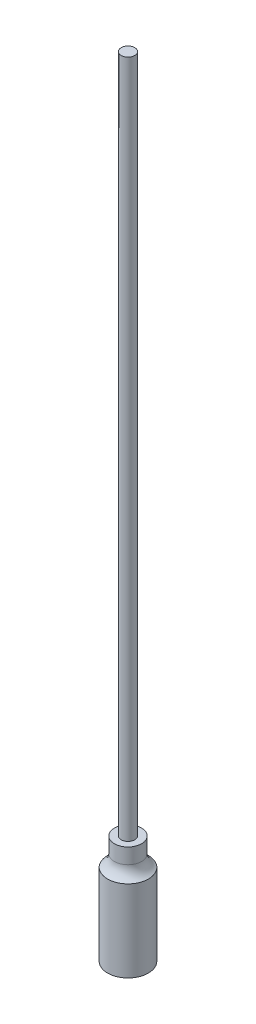
ISO-10303-21;
HEADER;
FILE_DESCRIPTION(('STEP AP214'),'2;1');
FILE_NAME('part.step','',(''),(''),'','','');
FILE_SCHEMA(('AUTOMOTIVE_DESIGN { 1 0 10303 214 1 1 1 1 }'));
ENDSEC;
DATA;
#1=APPLICATION_CONTEXT('core data for automotive mechanical design processes');
#2=APPLICATION_PROTOCOL_DEFINITION('international standard','automotive_design',2000,#1);
#3=PRODUCT_CONTEXT('',#1,'mechanical');
#4=PRODUCT('Part','Part','',(#3));
#5=PRODUCT_RELATED_PRODUCT_CATEGORY('part','',(#4));
#6=PRODUCT_DEFINITION_FORMATION('','',#4);
#7=PRODUCT_DEFINITION_CONTEXT('part definition',#1,'design');
#8=PRODUCT_DEFINITION('design','',#6,#7);
#9=PRODUCT_DEFINITION_SHAPE('','',#8);
#10=(LENGTH_UNIT() NAMED_UNIT(*) SI_UNIT(.MILLI.,.METRE.));
#11=(NAMED_UNIT(*) PLANE_ANGLE_UNIT() SI_UNIT($,.RADIAN.));
#12=(NAMED_UNIT(*) SI_UNIT($,.STERADIAN.) SOLID_ANGLE_UNIT());
#13=UNCERTAINTY_MEASURE_WITH_UNIT(LENGTH_MEASURE(1.E-05),#10,'distance_accuracy_value','');
#14=(GEOMETRIC_REPRESENTATION_CONTEXT(3) GLOBAL_UNCERTAINTY_ASSIGNED_CONTEXT((#13)) GLOBAL_UNIT_ASSIGNED_CONTEXT((#10,
#11,#12)) REPRESENTATION_CONTEXT('',''));
#15=CARTESIAN_POINT('',(0.,0.,0.));
#16=DIRECTION('',(0.,0.,1.));
#17=DIRECTION('',(1.,0.,0.));
#18=AXIS2_PLACEMENT_3D('',#15,#16,#17);
#19=CARTESIAN_POINT('',(0.,6.,0.));
#20=DIRECTION('',(0.,-1.,0.));
#21=DIRECTION('',(0.,0.,-1.));
#22=AXIS2_PLACEMENT_3D('',#19,#20,#21);
#23=CYLINDRICAL_SURFACE('',#22,1.5);
#24=CARTESIAN_POINT('',(0.,6.,0.));
#25=DIRECTION('',(0.,1.,0.));
#26=DIRECTION('',(0.,0.,1.));
#27=AXIS2_PLACEMENT_3D('',#24,#25,#26);
#28=CIRCLE('',#27,1.5);
#29=CARTESIAN_POINT('',(0.,6.,1.5));
#30=VERTEX_POINT('',#29);
#31=EDGE_CURVE('E55',#30,#30,#28,.T.);
#32=ORIENTED_EDGE('',*,*,#31,.F.);
#33=EDGE_LOOP('',(#32));
#34=FACE_BOUND('',#33,.T.);
#35=CARTESIAN_POINT('',(0.,0.,0.));
#36=DIRECTION('',(0.,1.,0.));
#37=DIRECTION('',(0.,0.,1.));
#38=AXIS2_PLACEMENT_3D('',#35,#36,#37);
#39=CIRCLE('',#38,1.5);
#40=CARTESIAN_POINT('',(0.,0.,1.5));
#41=VERTEX_POINT('',#40);
#42=EDGE_CURVE('E63',#41,#41,#39,.T.);
#43=ORIENTED_EDGE('',*,*,#42,.T.);
#44=EDGE_LOOP('',(#43));
#45=FACE_BOUND('',#44,.T.);
#46=ADVANCED_FACE('F41',(#34,#45),#23,.T.);
#47=CARTESIAN_POINT('',(0.,0.,0.));
#48=DIRECTION('',(0.,1.,0.));
#49=DIRECTION('',(0.,0.,1.));
#50=AXIS2_PLACEMENT_3D('',#47,#48,#49);
#51=PLANE('',#50);
#52=ORIENTED_EDGE('',*,*,#42,.F.);
#53=EDGE_LOOP('',(#52));
#54=FACE_BOUND('',#53,.T.);
#55=ADVANCED_FACE('F71',(#54),#51,.F.);
#56=CARTESIAN_POINT('',(0.,8.,0.));
#57=DIRECTION('',(0.,-1.,0.));
#58=DIRECTION('',(0.,0.,-1.));
#59=AXIS2_PLACEMENT_3D('',#56,#57,#58);
#60=CYLINDRICAL_SURFACE('',#59,1.);
#61=CARTESIAN_POINT('',(0.,6.86602540378444,0.));
#62=DIRECTION('',(0.,-1.,0.));
#63=DIRECTION('',(0.,0.,-1.));
#64=AXIS2_PLACEMENT_3D('',#61,#62,#63);
#65=CIRCLE('',#64,1.);
#66=CARTESIAN_POINT('',(0.,6.86602540378444,-1.));
#67=VERTEX_POINT('',#66);
#68=EDGE_CURVE('E45',#67,#67,#65,.F.);
#69=ORIENTED_EDGE('',*,*,#68,.T.);
#70=EDGE_LOOP('',(#69));
#71=FACE_BOUND('',#70,.T.);
#72=CARTESIAN_POINT('',(0.,8.,0.));
#73=DIRECTION('',(0.,1.,0.));
#74=DIRECTION('',(0.,0.,1.));
#75=AXIS2_PLACEMENT_3D('',#72,#73,#74);
#76=CIRCLE('',#75,1.);
#77=CARTESIAN_POINT('',(0.,8.,1.));
#78=VERTEX_POINT('',#77);
#79=EDGE_CURVE('E59',#78,#78,#76,.T.);
#80=ORIENTED_EDGE('',*,*,#79,.F.);
#81=EDGE_LOOP('',(#80));
#82=FACE_BOUND('',#81,.T.);
#83=ADVANCED_FACE('F73',(#71,#82),#60,.T.);
#84=CARTESIAN_POINT('',(0.,8.,0.));
#85=DIRECTION('',(0.,1.,0.));
#86=DIRECTION('',(0.,0.,1.));
#87=AXIS2_PLACEMENT_3D('',#84,#85,#86);
#88=PLANE('',#87);
#89=CARTESIAN_POINT('',(0.,8.,0.));
#90=DIRECTION('',(0.,1.,0.));
#91=DIRECTION('',(0.,0.,1.));
#92=AXIS2_PLACEMENT_3D('',#89,#90,#91);
#93=CIRCLE('',#92,0.5);
#94=CARTESIAN_POINT('',(0.,8.,0.5));
#95=VERTEX_POINT('',#94);
#96=EDGE_CURVE('E10',#95,#95,#93,.T.);
#97=ORIENTED_EDGE('',*,*,#96,.F.);
#98=EDGE_LOOP('',(#97));
#99=FACE_BOUND('',#98,.T.);
#100=ORIENTED_EDGE('',*,*,#79,.T.);
#101=EDGE_LOOP('',(#100));
#102=FACE_BOUND('',#101,.T.);
#103=ADVANCED_FACE('F79',(#99,#102),#88,.T.);
#104=CARTESIAN_POINT('',(0.,6.86602540378444,0.));
#105=DIRECTION('',(0.,-1.,0.));
#106=DIRECTION('',(0.,0.,-1.));
#107=AXIS2_PLACEMENT_3D('',#104,#105,#106);
#108=TOROIDAL_SURFACE('',#107,2.,1.);
#109=ORIENTED_EDGE('',*,*,#31,.T.);
#110=EDGE_LOOP('',(#109));
#111=FACE_BOUND('',#110,.T.);
#112=ORIENTED_EDGE('',*,*,#68,.F.);
#113=EDGE_LOOP('',(#112));
#114=FACE_BOUND('',#113,.T.);
#115=ADVANCED_FACE('F43',(#111,#114),#108,.F.);
#116=CARTESIAN_POINT('',(0.,58.,0.));
#117=DIRECTION('',(0.,-1.,0.));
#118=DIRECTION('',(0.,0.,-1.));
#119=AXIS2_PLACEMENT_3D('',#116,#117,#118);
#120=CYLINDRICAL_SURFACE('',#119,0.5);
#121=CARTESIAN_POINT('',(0.,58.,0.));
#122=DIRECTION('',(0.,1.,0.));
#123=DIRECTION('',(0.,0.,1.));
#124=AXIS2_PLACEMENT_3D('',#121,#122,#123);
#125=CIRCLE('',#124,0.5);
#126=CARTESIAN_POINT('',(0.,58.,0.5));
#127=VERTEX_POINT('',#126);
#128=EDGE_CURVE('E58',#127,#127,#125,.T.);
#129=ORIENTED_EDGE('',*,*,#128,.F.);
#130=EDGE_LOOP('',(#129));
#131=FACE_BOUND('',#130,.T.);
#132=ORIENTED_EDGE('',*,*,#96,.T.);
#133=EDGE_LOOP('',(#132));
#134=FACE_BOUND('',#133,.T.);
#135=ADVANCED_FACE('F87',(#131,#134),#120,.T.);
#136=CARTESIAN_POINT('',(0.,58.,0.));
#137=DIRECTION('',(0.,1.,0.));
#138=DIRECTION('',(0.,0.,1.));
#139=AXIS2_PLACEMENT_3D('',#136,#137,#138);
#140=PLANE('',#139);
#141=ORIENTED_EDGE('',*,*,#128,.T.);
#142=EDGE_LOOP('',(#141));
#143=FACE_BOUND('',#142,.T.);
#144=ADVANCED_FACE('F90',(#143),#140,.T.);
#145=CLOSED_SHELL('',(#46,#55,#83,#103,#115,#135,#144));
#146=MANIFOLD_SOLID_BREP('B2',#145);
#147=ADVANCED_BREP_SHAPE_REPRESENTATION('',(#18,#146),#14);
#148=SHAPE_DEFINITION_REPRESENTATION(#9,#147);
ENDSEC;
END-ISO-10303-21;
